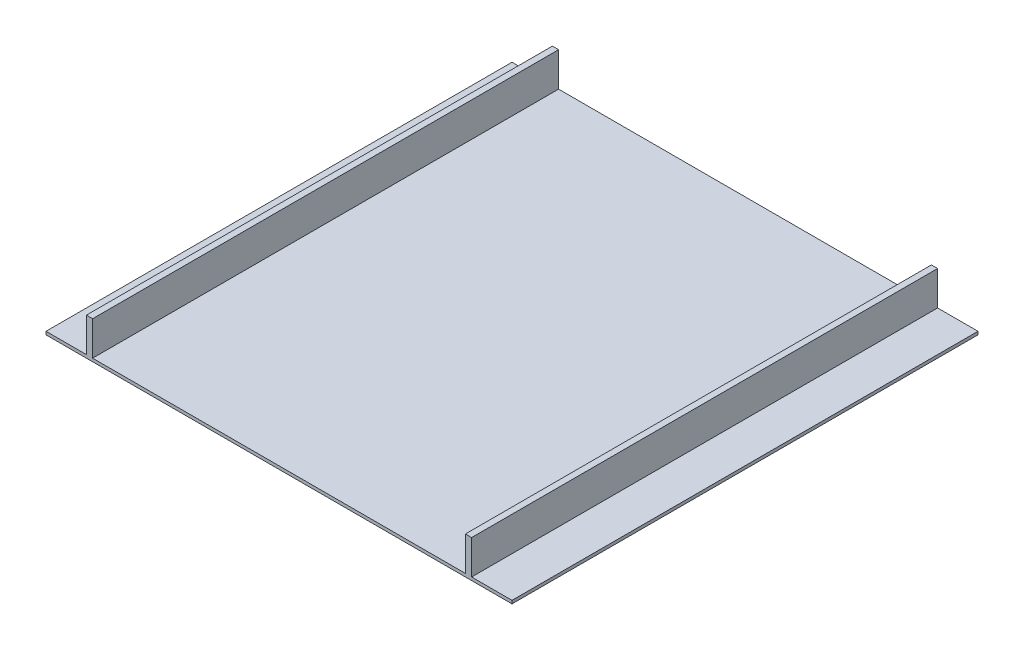
ISO-10303-21;
HEADER;
FILE_DESCRIPTION(('STEP AP214'),'2;1');
FILE_NAME('part.step','',(''),(''),'','','');
FILE_SCHEMA(('AUTOMOTIVE_DESIGN { 1 0 10303 214 1 1 1 1 }'));
ENDSEC;
DATA;
#1=APPLICATION_CONTEXT('core data for automotive mechanical design processes');
#2=APPLICATION_PROTOCOL_DEFINITION('international standard','automotive_design',2000,#1);
#3=PRODUCT_CONTEXT('',#1,'mechanical');
#4=PRODUCT('Part','Part','',(#3));
#5=PRODUCT_RELATED_PRODUCT_CATEGORY('part','',(#4));
#6=PRODUCT_DEFINITION_FORMATION('','',#4);
#7=PRODUCT_DEFINITION_CONTEXT('part definition',#1,'design');
#8=PRODUCT_DEFINITION('design','',#6,#7);
#9=PRODUCT_DEFINITION_SHAPE('','',#8);
#10=(LENGTH_UNIT() NAMED_UNIT(*) SI_UNIT(.MILLI.,.METRE.));
#11=(NAMED_UNIT(*) PLANE_ANGLE_UNIT() SI_UNIT($,.RADIAN.));
#12=(NAMED_UNIT(*) SI_UNIT($,.STERADIAN.) SOLID_ANGLE_UNIT());
#13=UNCERTAINTY_MEASURE_WITH_UNIT(LENGTH_MEASURE(1.E-05),#10,'distance_accuracy_value','');
#14=(GEOMETRIC_REPRESENTATION_CONTEXT(3) GLOBAL_UNCERTAINTY_ASSIGNED_CONTEXT((#13)) GLOBAL_UNIT_ASSIGNED_CONTEXT((#10,
#11,#12)) REPRESENTATION_CONTEXT('',''));
#15=CARTESIAN_POINT('',(0.,0.,0.));
#16=DIRECTION('',(0.,0.,1.));
#17=DIRECTION('',(1.,0.,0.));
#18=AXIS2_PLACEMENT_3D('',#15,#16,#17);
#19=CARTESIAN_POINT('',(0.,10.,0.));
#20=DIRECTION('',(0.,1.,0.));
#21=DIRECTION('',(0.,0.,1.));
#22=AXIS2_PLACEMENT_3D('',#19,#20,#21);
#23=PLANE('',#22);
#24=DIRECTION('',(1.,0.,0.));
#25=VECTOR('',#24,1.);
#26=CARTESIAN_POINT('',(-750.,10.,750.));
#27=LINE('',#26,#25);
#28=CARTESIAN_POINT('',(-750.,10.,750.));
#29=VERTEX_POINT('',#28);
#30=CARTESIAN_POINT('',(-620.,10.,750.));
#31=VERTEX_POINT('',#30);
#32=EDGE_CURVE('E62',#29,#31,#27,.T.);
#33=ORIENTED_EDGE('',*,*,#32,.T.);
#34=DIRECTION('',(0.,0.,1.));
#35=VECTOR('',#34,1.);
#36=CARTESIAN_POINT('',(-620.,10.,-750.));
#37=LINE('',#36,#35);
#38=CARTESIAN_POINT('',(-620.,10.,-750.));
#39=VERTEX_POINT('',#38);
#40=EDGE_CURVE('E150',#39,#31,#37,.T.);
#41=ORIENTED_EDGE('',*,*,#40,.F.);
#42=DIRECTION('',(-1.,0.,0.));
#43=VECTOR('',#42,1.);
#44=CARTESIAN_POINT('',(-750.,10.,-750.));
#45=LINE('',#44,#43);
#46=CARTESIAN_POINT('',(-750.,10.,-750.));
#47=VERTEX_POINT('',#46);
#48=EDGE_CURVE('E182',#39,#47,#45,.T.);
#49=ORIENTED_EDGE('',*,*,#48,.T.);
#50=DIRECTION('',(0.,0.,1.));
#51=VECTOR('',#50,1.);
#52=CARTESIAN_POINT('',(-750.,10.,-750.));
#53=LINE('',#52,#51);
#54=EDGE_CURVE('E188',#47,#29,#53,.T.);
#55=ORIENTED_EDGE('',*,*,#54,.T.);
#56=EDGE_LOOP('',(#33,#41,#49,#55));
#57=FACE_BOUND('',#56,.T.);
#58=ADVANCED_FACE('F36',(#57),#23,.T.);
#59=CARTESIAN_POINT('',(600.,10.,-750.));
#60=VERTEX_POINT('',#59);
#61=CARTESIAN_POINT('',(-600.,10.,-750.));
#62=VERTEX_POINT('',#61);
#63=EDGE_CURVE('E184',#60,#62,#45,.T.);
#64=ORIENTED_EDGE('',*,*,#63,.T.);
#65=DIRECTION('',(0.,0.,-1.));
#66=VECTOR('',#65,1.);
#67=CARTESIAN_POINT('',(-600.,10.,-750.));
#68=LINE('',#67,#66);
#69=CARTESIAN_POINT('',(-600.,10.,750.));
#70=VERTEX_POINT('',#69);
#71=EDGE_CURVE('E54',#70,#62,#68,.T.);
#72=ORIENTED_EDGE('',*,*,#71,.F.);
#73=CARTESIAN_POINT('',(600.,10.,750.));
#74=VERTEX_POINT('',#73);
#75=EDGE_CURVE('E40',#70,#74,#27,.T.);
#76=ORIENTED_EDGE('',*,*,#75,.T.);
#77=DIRECTION('',(0.,0.,1.));
#78=VECTOR('',#77,1.);
#79=CARTESIAN_POINT('',(600.,10.,-750.));
#80=LINE('',#79,#78);
#81=EDGE_CURVE('E154',#60,#74,#80,.T.);
#82=ORIENTED_EDGE('',*,*,#81,.F.);
#83=EDGE_LOOP('',(#64,#72,#76,#82));
#84=FACE_BOUND('',#83,.T.);
#85=ADVANCED_FACE('F273',(#84),#23,.T.);
#86=DIRECTION('',(0.,0.,-1.));
#87=VECTOR('',#86,1.);
#88=CARTESIAN_POINT('',(620.,10.,-750.));
#89=LINE('',#88,#87);
#90=CARTESIAN_POINT('',(620.,10.,750.));
#91=VERTEX_POINT('',#90);
#92=CARTESIAN_POINT('',(620.,10.,-750.));
#93=VERTEX_POINT('',#92);
#94=EDGE_CURVE('E151',#91,#93,#89,.T.);
#95=ORIENTED_EDGE('',*,*,#94,.F.);
#96=CARTESIAN_POINT('',(750.,10.,750.));
#97=VERTEX_POINT('',#96);
#98=EDGE_CURVE('E217',#91,#97,#27,.T.);
#99=ORIENTED_EDGE('',*,*,#98,.T.);
#100=DIRECTION('',(0.,0.,-1.));
#101=VECTOR('',#100,1.);
#102=CARTESIAN_POINT('',(750.,10.,-750.));
#103=LINE('',#102,#101);
#104=CARTESIAN_POINT('',(750.,10.,-750.));
#105=VERTEX_POINT('',#104);
#106=EDGE_CURVE('E185',#97,#105,#103,.T.);
#107=ORIENTED_EDGE('',*,*,#106,.T.);
#108=EDGE_CURVE('E194',#105,#93,#45,.T.);
#109=ORIENTED_EDGE('',*,*,#108,.T.);
#110=EDGE_LOOP('',(#95,#99,#107,#109));
#111=FACE_BOUND('',#110,.T.);
#112=ADVANCED_FACE('F275',(#111),#23,.T.);
#113=CARTESIAN_POINT('',(750.,10.,-750.));
#114=DIRECTION('',(-1.,0.,0.));
#115=DIRECTION('',(0.,0.,1.));
#116=AXIS2_PLACEMENT_3D('',#113,#114,#115);
#117=PLANE('',#116);
#118=DIRECTION('',(0.,0.,-1.));
#119=VECTOR('',#118,1.);
#120=CARTESIAN_POINT('',(750.,0.,-750.));
#121=LINE('',#120,#119);
#122=CARTESIAN_POINT('',(750.,0.,750.));
#123=VERTEX_POINT('',#122);
#124=CARTESIAN_POINT('',(750.,0.,-750.));
#125=VERTEX_POINT('',#124);
#126=EDGE_CURVE('E210',#123,#125,#121,.T.);
#127=ORIENTED_EDGE('',*,*,#126,.T.);
#128=DIRECTION('',(0.,-1.,0.));
#129=VECTOR('',#128,1.);
#130=CARTESIAN_POINT('',(750.,10.,-750.));
#131=LINE('',#130,#129);
#132=EDGE_CURVE('E11',#105,#125,#131,.T.);
#133=ORIENTED_EDGE('',*,*,#132,.F.);
#134=ORIENTED_EDGE('',*,*,#106,.F.);
#135=DIRECTION('',(0.,-1.,0.));
#136=VECTOR('',#135,1.);
#137=CARTESIAN_POINT('',(750.,10.,750.));
#138=LINE('',#137,#136);
#139=EDGE_CURVE('E201',#97,#123,#138,.T.);
#140=ORIENTED_EDGE('',*,*,#139,.T.);
#141=EDGE_LOOP('',(#127,#133,#134,#140));
#142=FACE_BOUND('',#141,.T.);
#143=ADVANCED_FACE('F38',(#142),#117,.F.);
#144=CARTESIAN_POINT('',(-750.,10.,-750.));
#145=DIRECTION('',(0.,0.,1.));
#146=DIRECTION('',(1.,0.,0.));
#147=AXIS2_PLACEMENT_3D('',#144,#145,#146);
#148=PLANE('',#147);
#149=DIRECTION('',(-1.,0.,0.));
#150=VECTOR('',#149,1.);
#151=CARTESIAN_POINT('',(-750.,0.,-750.));
#152=LINE('',#151,#150);
#153=CARTESIAN_POINT('',(-750.,0.,-750.));
#154=VERTEX_POINT('',#153);
#155=EDGE_CURVE('E208',#125,#154,#152,.T.);
#156=ORIENTED_EDGE('',*,*,#155,.T.);
#157=DIRECTION('',(0.,-1.,0.));
#158=VECTOR('',#157,1.);
#159=CARTESIAN_POINT('',(-750.,10.,-750.));
#160=LINE('',#159,#158);
#161=EDGE_CURVE('E46',#47,#154,#160,.T.);
#162=ORIENTED_EDGE('',*,*,#161,.F.);
#163=ORIENTED_EDGE('',*,*,#48,.F.);
#164=DIRECTION('',(0.,-1.,0.));
#165=VECTOR('',#164,1.);
#166=CARTESIAN_POINT('',(-620.,120.,-750.));
#167=LINE('',#166,#165);
#168=CARTESIAN_POINT('',(-620.,120.,-750.));
#169=VERTEX_POINT('',#168);
#170=EDGE_CURVE('E347',#169,#39,#167,.T.);
#171=ORIENTED_EDGE('',*,*,#170,.F.);
#172=DIRECTION('',(-1.,0.,0.));
#173=VECTOR('',#172,1.);
#174=CARTESIAN_POINT('',(-620.,120.,-750.));
#175=LINE('',#174,#173);
#176=CARTESIAN_POINT('',(-600.,120.,-750.));
#177=VERTEX_POINT('',#176);
#178=EDGE_CURVE('E144',#177,#169,#175,.T.);
#179=ORIENTED_EDGE('',*,*,#178,.F.);
#180=DIRECTION('',(0.,-1.,0.));
#181=VECTOR('',#180,1.);
#182=CARTESIAN_POINT('',(-600.,120.,-750.));
#183=LINE('',#182,#181);
#184=EDGE_CURVE('E156',#177,#62,#183,.T.);
#185=ORIENTED_EDGE('',*,*,#184,.T.);
#186=ORIENTED_EDGE('',*,*,#63,.F.);
#187=DIRECTION('',(0.,-1.,0.));
#188=VECTOR('',#187,1.);
#189=CARTESIAN_POINT('',(600.,120.,-750.));
#190=LINE('',#189,#188);
#191=CARTESIAN_POINT('',(600.,120.,-750.));
#192=VERTEX_POINT('',#191);
#193=EDGE_CURVE('E251',#192,#60,#190,.T.);
#194=ORIENTED_EDGE('',*,*,#193,.F.);
#195=DIRECTION('',(-1.,0.,0.));
#196=VECTOR('',#195,1.);
#197=CARTESIAN_POINT('',(600.,120.,-750.));
#198=LINE('',#197,#196);
#199=CARTESIAN_POINT('',(620.,120.,-750.));
#200=VERTEX_POINT('',#199);
#201=EDGE_CURVE('E163',#200,#192,#198,.T.);
#202=ORIENTED_EDGE('',*,*,#201,.F.);
#203=DIRECTION('',(0.,-1.,0.));
#204=VECTOR('',#203,1.);
#205=CARTESIAN_POINT('',(620.,120.,-750.));
#206=LINE('',#205,#204);
#207=EDGE_CURVE('E212',#200,#93,#206,.T.);
#208=ORIENTED_EDGE('',*,*,#207,.T.);
#209=ORIENTED_EDGE('',*,*,#108,.F.);
#210=ORIENTED_EDGE('',*,*,#132,.T.);
#211=EDGE_LOOP('',(#156,#162,#163,#171,#179,#185,#186,#194,#202,#208,#209,#210));
#212=FACE_BOUND('',#211,.T.);
#213=ADVANCED_FACE('F260',(#212),#148,.F.);
#214=CARTESIAN_POINT('',(-750.,10.,-750.));
#215=DIRECTION('',(1.,0.,0.));
#216=DIRECTION('',(0.,0.,-1.));
#217=AXIS2_PLACEMENT_3D('',#214,#215,#216);
#218=PLANE('',#217);
#219=DIRECTION('',(0.,0.,1.));
#220=VECTOR('',#219,1.);
#221=CARTESIAN_POINT('',(-750.,0.,-750.));
#222=LINE('',#221,#220);
#223=CARTESIAN_POINT('',(-750.,0.,750.));
#224=VERTEX_POINT('',#223);
#225=EDGE_CURVE('E206',#154,#224,#222,.T.);
#226=ORIENTED_EDGE('',*,*,#225,.T.);
#227=DIRECTION('',(0.,-1.,0.));
#228=VECTOR('',#227,1.);
#229=CARTESIAN_POINT('',(-750.,10.,750.));
#230=LINE('',#229,#228);
#231=EDGE_CURVE('E198',#29,#224,#230,.T.);
#232=ORIENTED_EDGE('',*,*,#231,.F.);
#233=ORIENTED_EDGE('',*,*,#54,.F.);
#234=ORIENTED_EDGE('',*,*,#161,.T.);
#235=EDGE_LOOP('',(#226,#232,#233,#234));
#236=FACE_BOUND('',#235,.T.);
#237=ADVANCED_FACE('F228',(#236),#218,.F.);
#238=CARTESIAN_POINT('',(-750.,10.,750.));
#239=DIRECTION('',(0.,0.,-1.));
#240=DIRECTION('',(-1.,0.,0.));
#241=AXIS2_PLACEMENT_3D('',#238,#239,#240);
#242=PLANE('',#241);
#243=DIRECTION('',(1.,0.,0.));
#244=VECTOR('',#243,1.);
#245=CARTESIAN_POINT('',(-750.,0.,750.));
#246=LINE('',#245,#244);
#247=EDGE_CURVE('E204',#224,#123,#246,.T.);
#248=ORIENTED_EDGE('',*,*,#247,.T.);
#249=ORIENTED_EDGE('',*,*,#139,.F.);
#250=ORIENTED_EDGE('',*,*,#98,.F.);
#251=DIRECTION('',(0.,-1.,0.));
#252=VECTOR('',#251,1.);
#253=CARTESIAN_POINT('',(620.,120.,750.));
#254=LINE('',#253,#252);
#255=CARTESIAN_POINT('',(620.,120.,750.));
#256=VERTEX_POINT('',#255);
#257=EDGE_CURVE('E169',#256,#91,#254,.T.);
#258=ORIENTED_EDGE('',*,*,#257,.F.);
#259=DIRECTION('',(1.,0.,0.));
#260=VECTOR('',#259,1.);
#261=CARTESIAN_POINT('',(600.,120.,750.));
#262=LINE('',#261,#260);
#263=CARTESIAN_POINT('',(600.,120.,750.));
#264=VERTEX_POINT('',#263);
#265=EDGE_CURVE('E167',#264,#256,#262,.T.);
#266=ORIENTED_EDGE('',*,*,#265,.F.);
#267=DIRECTION('',(0.,-1.,0.));
#268=VECTOR('',#267,1.);
#269=CARTESIAN_POINT('',(600.,120.,750.));
#270=LINE('',#269,#268);
#271=EDGE_CURVE('E180',#264,#74,#270,.T.);
#272=ORIENTED_EDGE('',*,*,#271,.T.);
#273=ORIENTED_EDGE('',*,*,#75,.F.);
#274=DIRECTION('',(0.,-1.,0.));
#275=VECTOR('',#274,1.);
#276=CARTESIAN_POINT('',(-600.,120.,750.));
#277=LINE('',#276,#275);
#278=CARTESIAN_POINT('',(-600.,120.,750.));
#279=VERTEX_POINT('',#278);
#280=EDGE_CURVE('E135',#279,#70,#277,.T.);
#281=ORIENTED_EDGE('',*,*,#280,.F.);
#282=DIRECTION('',(1.,0.,0.));
#283=VECTOR('',#282,1.);
#284=CARTESIAN_POINT('',(-620.,120.,750.));
#285=LINE('',#284,#283);
#286=CARTESIAN_POINT('',(-620.,120.,750.));
#287=VERTEX_POINT('',#286);
#288=EDGE_CURVE('E128',#287,#279,#285,.T.);
#289=ORIENTED_EDGE('',*,*,#288,.F.);
#290=DIRECTION('',(0.,-1.,0.));
#291=VECTOR('',#290,1.);
#292=CARTESIAN_POINT('',(-620.,120.,750.));
#293=LINE('',#292,#291);
#294=EDGE_CURVE('E132',#287,#31,#293,.T.);
#295=ORIENTED_EDGE('',*,*,#294,.T.);
#296=ORIENTED_EDGE('',*,*,#32,.F.);
#297=ORIENTED_EDGE('',*,*,#231,.T.);
#298=EDGE_LOOP('',(#248,#249,#250,#258,#266,#272,#273,#281,#289,#295,#296,#297));
#299=FACE_BOUND('',#298,.T.);
#300=ADVANCED_FACE('F130',(#299),#242,.F.);
#301=CARTESIAN_POINT('',(0.,0.,0.));
#302=DIRECTION('',(0.,1.,0.));
#303=DIRECTION('',(0.,0.,1.));
#304=AXIS2_PLACEMENT_3D('',#301,#302,#303);
#305=PLANE('',#304);
#306=ORIENTED_EDGE('',*,*,#126,.F.);
#307=ORIENTED_EDGE('',*,*,#247,.F.);
#308=ORIENTED_EDGE('',*,*,#225,.F.);
#309=ORIENTED_EDGE('',*,*,#155,.F.);
#310=EDGE_LOOP('',(#306,#307,#308,#309));
#311=FACE_BOUND('',#310,.T.);
#312=ADVANCED_FACE('F233',(#311),#305,.F.);
#313=CARTESIAN_POINT('',(620.,120.,-750.));
#314=DIRECTION('',(-1.,0.,0.));
#315=DIRECTION('',(0.,0.,1.));
#316=AXIS2_PLACEMENT_3D('',#313,#314,#315);
#317=PLANE('',#316);
#318=ORIENTED_EDGE('',*,*,#94,.T.);
#319=ORIENTED_EDGE('',*,*,#207,.F.);
#320=DIRECTION('',(0.,0.,-1.));
#321=VECTOR('',#320,1.);
#322=CARTESIAN_POINT('',(620.,120.,-750.));
#323=LINE('',#322,#321);
#324=EDGE_CURVE('E160',#256,#200,#323,.T.);
#325=ORIENTED_EDGE('',*,*,#324,.F.);
#326=ORIENTED_EDGE('',*,*,#257,.T.);
#327=EDGE_LOOP('',(#318,#319,#325,#326));
#328=FACE_BOUND('',#327,.T.);
#329=ADVANCED_FACE('F241',(#328),#317,.F.);
#330=CARTESIAN_POINT('',(600.,120.,-750.));
#331=DIRECTION('',(1.,0.,0.));
#332=DIRECTION('',(0.,0.,-1.));
#333=AXIS2_PLACEMENT_3D('',#330,#331,#332);
#334=PLANE('',#333);
#335=ORIENTED_EDGE('',*,*,#81,.T.);
#336=ORIENTED_EDGE('',*,*,#271,.F.);
#337=DIRECTION('',(0.,0.,1.));
#338=VECTOR('',#337,1.);
#339=CARTESIAN_POINT('',(600.,120.,-750.));
#340=LINE('',#339,#338);
#341=EDGE_CURVE('E165',#192,#264,#340,.T.);
#342=ORIENTED_EDGE('',*,*,#341,.F.);
#343=ORIENTED_EDGE('',*,*,#193,.T.);
#344=EDGE_LOOP('',(#335,#336,#342,#343));
#345=FACE_BOUND('',#344,.T.);
#346=ADVANCED_FACE('F263',(#345),#334,.F.);
#347=CARTESIAN_POINT('',(0.,120.,0.));
#348=DIRECTION('',(0.,1.,0.));
#349=DIRECTION('',(0.,0.,1.));
#350=AXIS2_PLACEMENT_3D('',#347,#348,#349);
#351=PLANE('',#350);
#352=ORIENTED_EDGE('',*,*,#324,.T.);
#353=ORIENTED_EDGE('',*,*,#201,.T.);
#354=ORIENTED_EDGE('',*,*,#341,.T.);
#355=ORIENTED_EDGE('',*,*,#265,.T.);
#356=EDGE_LOOP('',(#352,#353,#354,#355));
#357=FACE_BOUND('',#356,.T.);
#358=ADVANCED_FACE('F245',(#357),#351,.T.);
#359=CARTESIAN_POINT('',(-620.,120.,-750.));
#360=DIRECTION('',(1.,0.,0.));
#361=DIRECTION('',(0.,0.,-1.));
#362=AXIS2_PLACEMENT_3D('',#359,#360,#361);
#363=PLANE('',#362);
#364=ORIENTED_EDGE('',*,*,#40,.T.);
#365=ORIENTED_EDGE('',*,*,#294,.F.);
#366=DIRECTION('',(0.,0.,1.));
#367=VECTOR('',#366,1.);
#368=CARTESIAN_POINT('',(-620.,120.,-750.));
#369=LINE('',#368,#367);
#370=EDGE_CURVE('E139',#169,#287,#369,.T.);
#371=ORIENTED_EDGE('',*,*,#370,.F.);
#372=ORIENTED_EDGE('',*,*,#170,.T.);
#373=EDGE_LOOP('',(#364,#365,#371,#372));
#374=FACE_BOUND('',#373,.T.);
#375=ADVANCED_FACE('F149',(#374),#363,.F.);
#376=CARTESIAN_POINT('',(-600.,120.,-750.));
#377=DIRECTION('',(-1.,0.,0.));
#378=DIRECTION('',(0.,0.,1.));
#379=AXIS2_PLACEMENT_3D('',#376,#377,#378);
#380=PLANE('',#379);
#381=ORIENTED_EDGE('',*,*,#71,.T.);
#382=ORIENTED_EDGE('',*,*,#184,.F.);
#383=DIRECTION('',(0.,0.,-1.));
#384=VECTOR('',#383,1.);
#385=CARTESIAN_POINT('',(-600.,120.,-750.));
#386=LINE('',#385,#384);
#387=EDGE_CURVE('E138',#279,#177,#386,.T.);
#388=ORIENTED_EDGE('',*,*,#387,.F.);
#389=ORIENTED_EDGE('',*,*,#280,.T.);
#390=EDGE_LOOP('',(#381,#382,#388,#389));
#391=FACE_BOUND('',#390,.T.);
#392=ADVANCED_FACE('F324',(#391),#380,.F.);
#393=CARTESIAN_POINT('',(0.,120.,0.));
#394=DIRECTION('',(0.,1.,0.));
#395=DIRECTION('',(0.,0.,1.));
#396=AXIS2_PLACEMENT_3D('',#393,#394,#395);
#397=PLANE('',#396);
#398=ORIENTED_EDGE('',*,*,#370,.T.);
#399=ORIENTED_EDGE('',*,*,#288,.T.);
#400=ORIENTED_EDGE('',*,*,#387,.T.);
#401=ORIENTED_EDGE('',*,*,#178,.T.);
#402=EDGE_LOOP('',(#398,#399,#400,#401));
#403=FACE_BOUND('',#402,.T.);
#404=ADVANCED_FACE('F142',(#403),#397,.T.);
#405=CLOSED_SHELL('',(#58,#85,#112,#143,#213,#237,#300,#312,#329,#346,#358,#375,#392,#404));
#406=MANIFOLD_SOLID_BREP('B2',#405);
#407=ADVANCED_BREP_SHAPE_REPRESENTATION('',(#18,#406),#14);
#408=SHAPE_DEFINITION_REPRESENTATION(#9,#407);
ENDSEC;
END-ISO-10303-21;
